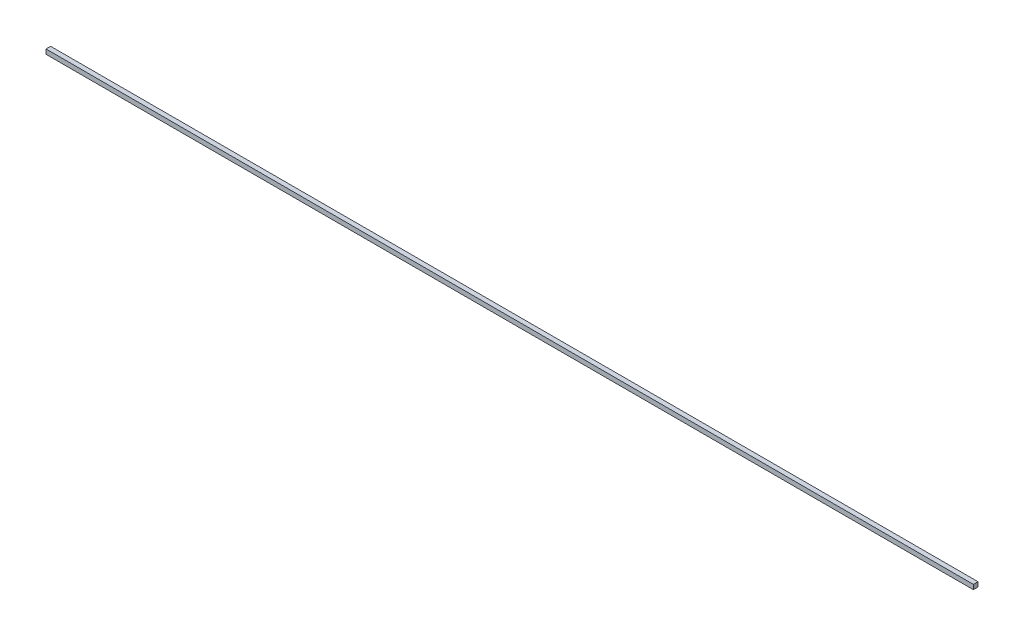
ISO-10303-21;
HEADER;
FILE_DESCRIPTION(('STEP AP214'),'2;1');
FILE_NAME('part.step','',(''),(''),'','','');
FILE_SCHEMA(('AUTOMOTIVE_DESIGN { 1 0 10303 214 1 1 1 1 }'));
ENDSEC;
DATA;
#1=APPLICATION_CONTEXT('core data for automotive mechanical design processes');
#2=APPLICATION_PROTOCOL_DEFINITION('international standard','automotive_design',2000,#1);
#3=PRODUCT_CONTEXT('',#1,'mechanical');
#4=PRODUCT('Part','Part','',(#3));
#5=PRODUCT_RELATED_PRODUCT_CATEGORY('part','',(#4));
#6=PRODUCT_DEFINITION_FORMATION('','',#4);
#7=PRODUCT_DEFINITION_CONTEXT('part definition',#1,'design');
#8=PRODUCT_DEFINITION('design','',#6,#7);
#9=PRODUCT_DEFINITION_SHAPE('','',#8);
#10=(LENGTH_UNIT() NAMED_UNIT(*) SI_UNIT(.MILLI.,.METRE.));
#11=(NAMED_UNIT(*) PLANE_ANGLE_UNIT() SI_UNIT($,.RADIAN.));
#12=(NAMED_UNIT(*) SI_UNIT($,.STERADIAN.) SOLID_ANGLE_UNIT());
#13=UNCERTAINTY_MEASURE_WITH_UNIT(LENGTH_MEASURE(1.E-05),#10,'distance_accuracy_value','');
#14=(GEOMETRIC_REPRESENTATION_CONTEXT(3) GLOBAL_UNCERTAINTY_ASSIGNED_CONTEXT((#13)) GLOBAL_UNIT_ASSIGNED_CONTEXT((#10,
#11,#12)) REPRESENTATION_CONTEXT('',''));
#15=CARTESIAN_POINT('',(0.,0.,0.));
#16=DIRECTION('',(0.,0.,1.));
#17=DIRECTION('',(1.,0.,0.));
#18=AXIS2_PLACEMENT_3D('',#15,#16,#17);
#19=CARTESIAN_POINT('',(0.,0.,3.));
#20=DIRECTION('',(0.,0.,1.));
#21=DIRECTION('',(1.,0.,0.));
#22=AXIS2_PLACEMENT_3D('',#19,#20,#21);
#23=PLANE('',#22);
#24=DIRECTION('',(0.,1.,0.));
#25=VECTOR('',#24,1.);
#26=CARTESIAN_POINT('',(-300.,0.,3.));
#27=LINE('',#26,#25);
#28=CARTESIAN_POINT('',(-300.,47.,3.));
#29=VERTEX_POINT('',#28);
#30=CARTESIAN_POINT('',(-300.,50.,3.));
#31=VERTEX_POINT('',#30);
#32=EDGE_CURVE('E78',#29,#31,#27,.T.);
#33=ORIENTED_EDGE('',*,*,#32,.F.);
#34=DIRECTION('',(1.,0.,0.));
#35=VECTOR('',#34,1.);
#36=CARTESIAN_POINT('',(300.,47.,3.));
#37=LINE('',#36,#35);
#38=CARTESIAN_POINT('',(300.,47.,3.));
#39=VERTEX_POINT('',#38);
#40=EDGE_CURVE('E89',#29,#39,#37,.T.);
#41=ORIENTED_EDGE('',*,*,#40,.T.);
#42=DIRECTION('',(0.,1.,0.));
#43=VECTOR('',#42,1.);
#44=CARTESIAN_POINT('',(300.,1.71683972880179E-13,3.));
#45=LINE('',#44,#43);
#46=CARTESIAN_POINT('',(300.,50.,3.));
#47=VERTEX_POINT('',#46);
#48=EDGE_CURVE('E85',#39,#47,#45,.T.);
#49=ORIENTED_EDGE('',*,*,#48,.T.);
#50=DIRECTION('',(-1.,0.,0.));
#51=VECTOR('',#50,1.);
#52=CARTESIAN_POINT('',(-300.,50.,3.));
#53=LINE('',#52,#51);
#54=EDGE_CURVE('E73',#47,#31,#53,.T.);
#55=ORIENTED_EDGE('',*,*,#54,.T.);
#56=EDGE_LOOP('',(#33,#41,#49,#55));
#57=FACE_BOUND('',#56,.T.);
#58=ADVANCED_FACE('F32',(#57),#23,.T.);
#59=CARTESIAN_POINT('',(300.,1.71683972880179E-13,0.));
#60=DIRECTION('',(-1.,0.,0.));
#61=DIRECTION('',(0.,-1.,0.));
#62=AXIS2_PLACEMENT_3D('',#59,#60,#61);
#63=PLANE('',#62);
#64=ORIENTED_EDGE('',*,*,#48,.F.);
#65=DIRECTION('',(0.,0.,1.));
#66=VECTOR('',#65,1.);
#67=CARTESIAN_POINT('',(300.,47.,3.));
#68=LINE('',#67,#66);
#69=CARTESIAN_POINT('',(300.,47.,0.));
#70=VERTEX_POINT('',#69);
#71=EDGE_CURVE('E84',#70,#39,#68,.T.);
#72=ORIENTED_EDGE('',*,*,#71,.F.);
#73=DIRECTION('',(0.,-1.,0.));
#74=VECTOR('',#73,1.);
#75=CARTESIAN_POINT('',(300.,3.43367945760358E-13,0.));
#76=LINE('',#75,#74);
#77=CARTESIAN_POINT('',(300.,50.,0.));
#78=VERTEX_POINT('',#77);
#79=EDGE_CURVE('E97',#78,#70,#76,.T.);
#80=ORIENTED_EDGE('',*,*,#79,.F.);
#81=DIRECTION('',(0.,0.,-1.));
#82=VECTOR('',#81,1.);
#83=CARTESIAN_POINT('',(300.,50.,60.));
#84=LINE('',#83,#82);
#85=EDGE_CURVE('E95',#47,#78,#84,.T.);
#86=ORIENTED_EDGE('',*,*,#85,.F.);
#87=EDGE_LOOP('',(#64,#72,#80,#86));
#88=FACE_BOUND('',#87,.T.);
#89=ADVANCED_FACE('F105',(#88),#63,.F.);
#90=CARTESIAN_POINT('',(-300.,0.,0.));
#91=DIRECTION('',(-1.,0.,0.));
#92=DIRECTION('',(0.,0.,1.));
#93=AXIS2_PLACEMENT_3D('',#90,#91,#92);
#94=PLANE('',#93);
#95=DIRECTION('',(0.,0.,1.));
#96=VECTOR('',#95,1.);
#97=CARTESIAN_POINT('',(-300.,47.,3.));
#98=LINE('',#97,#96);
#99=CARTESIAN_POINT('',(-300.,47.,0.));
#100=VERTEX_POINT('',#99);
#101=EDGE_CURVE('E11',#100,#29,#98,.T.);
#102=ORIENTED_EDGE('',*,*,#101,.T.);
#103=ORIENTED_EDGE('',*,*,#32,.T.);
#104=DIRECTION('',(0.,0.,-1.));
#105=VECTOR('',#104,1.);
#106=CARTESIAN_POINT('',(-300.,50.,60.));
#107=LINE('',#106,#105);
#108=CARTESIAN_POINT('',(-300.,50.,0.));
#109=VERTEX_POINT('',#108);
#110=EDGE_CURVE('E40',#31,#109,#107,.T.);
#111=ORIENTED_EDGE('',*,*,#110,.T.);
#112=DIRECTION('',(0.,-1.,0.));
#113=VECTOR('',#112,1.);
#114=CARTESIAN_POINT('',(-300.,0.,0.));
#115=LINE('',#114,#113);
#116=EDGE_CURVE('E76',#109,#100,#115,.T.);
#117=ORIENTED_EDGE('',*,*,#116,.T.);
#118=EDGE_LOOP('',(#102,#103,#111,#117));
#119=FACE_BOUND('',#118,.T.);
#120=ADVANCED_FACE('F79',(#119),#94,.T.);
#121=CARTESIAN_POINT('',(300.,47.,3.));
#122=DIRECTION('',(0.,1.,0.));
#123=DIRECTION('',(0.,0.,1.));
#124=AXIS2_PLACEMENT_3D('',#121,#122,#123);
#125=PLANE('',#124);
#126=ORIENTED_EDGE('',*,*,#40,.F.);
#127=ORIENTED_EDGE('',*,*,#101,.F.);
#128=DIRECTION('',(1.,0.,0.));
#129=VECTOR('',#128,1.);
#130=CARTESIAN_POINT('',(-300.,47.,0.));
#131=LINE('',#130,#129);
#132=EDGE_CURVE('E54',#100,#70,#131,.T.);
#133=ORIENTED_EDGE('',*,*,#132,.T.);
#134=ORIENTED_EDGE('',*,*,#71,.T.);
#135=EDGE_LOOP('',(#126,#127,#133,#134));
#136=FACE_BOUND('',#135,.T.);
#137=ADVANCED_FACE('F34',(#136),#125,.F.);
#138=CARTESIAN_POINT('',(-300.,50.,60.));
#139=DIRECTION('',(0.,-1.,0.));
#140=DIRECTION('',(0.,0.,-1.));
#141=AXIS2_PLACEMENT_3D('',#138,#139,#140);
#142=PLANE('',#141);
#143=ORIENTED_EDGE('',*,*,#54,.F.);
#144=ORIENTED_EDGE('',*,*,#85,.T.);
#145=DIRECTION('',(-1.,0.,0.));
#146=VECTOR('',#145,1.);
#147=CARTESIAN_POINT('',(-300.,50.,0.));
#148=LINE('',#147,#146);
#149=EDGE_CURVE('E75',#78,#109,#148,.T.);
#150=ORIENTED_EDGE('',*,*,#149,.T.);
#151=ORIENTED_EDGE('',*,*,#110,.F.);
#152=EDGE_LOOP('',(#143,#144,#150,#151));
#153=FACE_BOUND('',#152,.T.);
#154=ADVANCED_FACE('F71',(#153),#142,.F.);
#155=CARTESIAN_POINT('',(-300.,0.,0.));
#156=DIRECTION('',(0.,0.,1.));
#157=DIRECTION('',(1.,0.,0.));
#158=AXIS2_PLACEMENT_3D('',#155,#156,#157);
#159=PLANE('',#158);
#160=ORIENTED_EDGE('',*,*,#116,.F.);
#161=ORIENTED_EDGE('',*,*,#149,.F.);
#162=ORIENTED_EDGE('',*,*,#79,.T.);
#163=ORIENTED_EDGE('',*,*,#132,.F.);
#164=EDGE_LOOP('',(#160,#161,#162,#163));
#165=FACE_BOUND('',#164,.T.);
#166=ADVANCED_FACE('F106',(#165),#159,.F.);
#167=CLOSED_SHELL('',(#58,#89,#120,#137,#154,#166));
#168=MANIFOLD_SOLID_BREP('B2',#167);
#169=ADVANCED_BREP_SHAPE_REPRESENTATION('',(#18,#168),#14);
#170=SHAPE_DEFINITION_REPRESENTATION(#9,#169);
ENDSEC;
END-ISO-10303-21;
